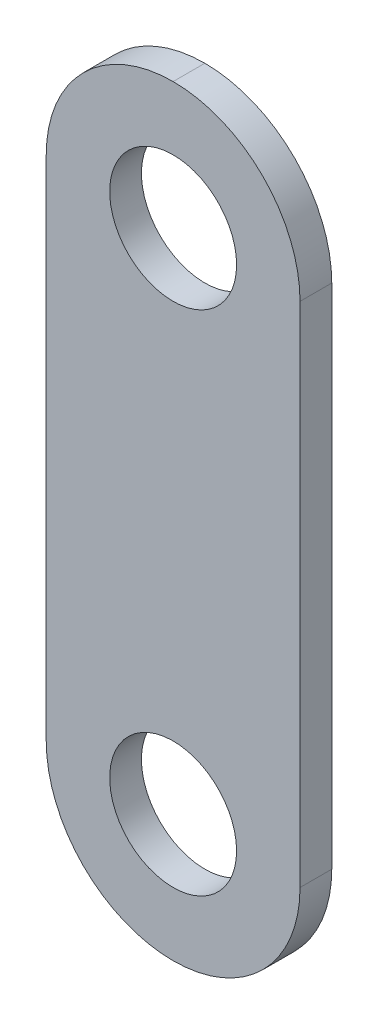
ISO-10303-21;
HEADER;
FILE_DESCRIPTION(('STEP AP214'),'2;1');
FILE_NAME('part.step','',(''),(''),'','','');
FILE_SCHEMA(('AUTOMOTIVE_DESIGN { 1 0 10303 214 1 1 1 1 }'));
ENDSEC;
DATA;
#1=APPLICATION_CONTEXT('core data for automotive mechanical design processes');
#2=APPLICATION_PROTOCOL_DEFINITION('international standard','automotive_design',2000,#1);
#3=PRODUCT_CONTEXT('',#1,'mechanical');
#4=PRODUCT('Part','Part','',(#3));
#5=PRODUCT_RELATED_PRODUCT_CATEGORY('part','',(#4));
#6=PRODUCT_DEFINITION_FORMATION('','',#4);
#7=PRODUCT_DEFINITION_CONTEXT('part definition',#1,'design');
#8=PRODUCT_DEFINITION('design','',#6,#7);
#9=PRODUCT_DEFINITION_SHAPE('','',#8);
#10=(LENGTH_UNIT() NAMED_UNIT(*) SI_UNIT(.MILLI.,.METRE.));
#11=(NAMED_UNIT(*) PLANE_ANGLE_UNIT() SI_UNIT($,.RADIAN.));
#12=(NAMED_UNIT(*) SI_UNIT($,.STERADIAN.) SOLID_ANGLE_UNIT());
#13=UNCERTAINTY_MEASURE_WITH_UNIT(LENGTH_MEASURE(1.E-05),#10,'distance_accuracy_value','');
#14=(GEOMETRIC_REPRESENTATION_CONTEXT(3) GLOBAL_UNCERTAINTY_ASSIGNED_CONTEXT((#13)) GLOBAL_UNIT_ASSIGNED_CONTEXT((#10,
#11,#12)) REPRESENTATION_CONTEXT('',''));
#15=CARTESIAN_POINT('',(0.,0.,0.));
#16=DIRECTION('',(0.,0.,1.));
#17=DIRECTION('',(1.,0.,0.));
#18=AXIS2_PLACEMENT_3D('',#15,#16,#17);
#19=CARTESIAN_POINT('',(0.,0.,1.5875));
#20=DIRECTION('',(0.,0.,-1.));
#21=DIRECTION('',(-1.,0.,0.));
#22=AXIS2_PLACEMENT_3D('',#19,#20,#21);
#23=PLANE('',#22);
#24=CARTESIAN_POINT('',(6.35,6.35,1.5875));
#25=DIRECTION('',(0.,0.,-1.));
#26=DIRECTION('',(-1.,0.,0.));
#27=AXIS2_PLACEMENT_3D('',#24,#25,#26);
#28=CIRCLE('',#27,6.35);
#29=CARTESIAN_POINT('',(0.,6.35,1.5875));
#30=VERTEX_POINT('',#29);
#31=CARTESIAN_POINT('',(6.35,0.,1.5875));
#32=VERTEX_POINT('',#31);
#33=EDGE_CURVE('E57',#30,#32,#28,.F.);
#34=ORIENTED_EDGE('',*,*,#33,.T.);
#35=CARTESIAN_POINT('',(6.35000000000001,6.35,1.5875));
#36=DIRECTION('',(0.,0.,-1.));
#37=DIRECTION('',(-1.,0.,0.));
#38=AXIS2_PLACEMENT_3D('',#35,#36,#37);
#39=CIRCLE('',#38,6.35);
#40=CARTESIAN_POINT('',(12.7,6.35,1.5875));
#41=VERTEX_POINT('',#40);
#42=EDGE_CURVE('E154',#32,#41,#39,.F.);
#43=ORIENTED_EDGE('',*,*,#42,.T.);
#44=DIRECTION('',(0.,1.,0.));
#45=VECTOR('',#44,1.);
#46=CARTESIAN_POINT('',(12.7,38.1,1.5875));
#47=LINE('',#46,#45);
#48=CARTESIAN_POINT('',(12.7,31.75,1.5875));
#49=VERTEX_POINT('',#48);
#50=EDGE_CURVE('E116',#41,#49,#47,.T.);
#51=ORIENTED_EDGE('',*,*,#50,.T.);
#52=CARTESIAN_POINT('',(6.35000000000001,31.75,1.5875));
#53=DIRECTION('',(0.,0.,-1.));
#54=DIRECTION('',(-1.,0.,0.));
#55=AXIS2_PLACEMENT_3D('',#52,#53,#54);
#56=CIRCLE('',#55,6.35);
#57=CARTESIAN_POINT('',(6.35,38.1,1.5875));
#58=VERTEX_POINT('',#57);
#59=EDGE_CURVE('E149',#49,#58,#56,.F.);
#60=ORIENTED_EDGE('',*,*,#59,.T.);
#61=CARTESIAN_POINT('',(6.35,31.75,1.5875));
#62=DIRECTION('',(0.,0.,-1.));
#63=DIRECTION('',(-1.,0.,0.));
#64=AXIS2_PLACEMENT_3D('',#61,#62,#63);
#65=CIRCLE('',#64,6.35);
#66=CARTESIAN_POINT('',(0.,31.75,1.5875));
#67=VERTEX_POINT('',#66);
#68=EDGE_CURVE('E105',#58,#67,#65,.F.);
#69=ORIENTED_EDGE('',*,*,#68,.T.);
#70=DIRECTION('',(0.,-1.,0.));
#71=VECTOR('',#70,1.);
#72=CARTESIAN_POINT('',(0.,0.,1.5875));
#73=LINE('',#72,#71);
#74=EDGE_CURVE('E136',#67,#30,#73,.T.);
#75=ORIENTED_EDGE('',*,*,#74,.T.);
#76=EDGE_LOOP('',(#34,#43,#51,#60,#69,#75));
#77=FACE_BOUND('',#76,.T.);
#78=CARTESIAN_POINT('',(6.35000000000001,31.75,1.5875));
#79=DIRECTION('',(0.,0.,1.));
#80=DIRECTION('',(1.,0.,0.));
#81=AXIS2_PLACEMENT_3D('',#78,#79,#80);
#82=CIRCLE('',#81,3.175);
#83=CARTESIAN_POINT('',(9.52500000000001,31.75,1.5875));
#84=VERTEX_POINT('',#83);
#85=EDGE_CURVE('E127',#84,#84,#82,.T.);
#86=ORIENTED_EDGE('',*,*,#85,.F.);
#87=EDGE_LOOP('',(#86));
#88=FACE_BOUND('',#87,.T.);
#89=CARTESIAN_POINT('',(6.35000000000001,6.35,1.5875));
#90=DIRECTION('',(0.,0.,1.));
#91=DIRECTION('',(1.,0.,0.));
#92=AXIS2_PLACEMENT_3D('',#89,#90,#91);
#93=CIRCLE('',#92,3.175);
#94=CARTESIAN_POINT('',(9.52500000000001,6.35,1.5875));
#95=VERTEX_POINT('',#94);
#96=EDGE_CURVE('E163',#95,#95,#93,.T.);
#97=ORIENTED_EDGE('',*,*,#96,.F.);
#98=EDGE_LOOP('',(#97));
#99=FACE_BOUND('',#98,.T.);
#100=ADVANCED_FACE('F39',(#77,#88,#99),#23,.F.);
#101=CARTESIAN_POINT('',(0.,0.,0.));
#102=DIRECTION('',(0.,0.,-1.));
#103=DIRECTION('',(-1.,0.,0.));
#104=AXIS2_PLACEMENT_3D('',#101,#102,#103);
#105=PLANE('',#104);
#106=CARTESIAN_POINT('',(6.35000000000001,31.75,0.));
#107=DIRECTION('',(0.,0.,1.));
#108=DIRECTION('',(1.,0.,0.));
#109=AXIS2_PLACEMENT_3D('',#106,#107,#108);
#110=CIRCLE('',#109,3.175);
#111=CARTESIAN_POINT('',(9.52500000000001,31.75,0.));
#112=VERTEX_POINT('',#111);
#113=EDGE_CURVE('E133',#112,#112,#110,.T.);
#114=ORIENTED_EDGE('',*,*,#113,.T.);
#115=EDGE_LOOP('',(#114));
#116=FACE_BOUND('',#115,.T.);
#117=DIRECTION('',(0.,1.,0.));
#118=VECTOR('',#117,1.);
#119=CARTESIAN_POINT('',(12.7,38.1,0.));
#120=LINE('',#119,#118);
#121=CARTESIAN_POINT('',(12.7,6.35,0.));
#122=VERTEX_POINT('',#121);
#123=CARTESIAN_POINT('',(12.7,31.75,0.));
#124=VERTEX_POINT('',#123);
#125=EDGE_CURVE('E113',#122,#124,#120,.T.);
#126=ORIENTED_EDGE('',*,*,#125,.F.);
#127=CARTESIAN_POINT('',(6.35000000000001,6.35,0.));
#128=DIRECTION('',(0.,0.,-1.));
#129=DIRECTION('',(-1.,0.,0.));
#130=AXIS2_PLACEMENT_3D('',#127,#128,#129);
#131=CIRCLE('',#130,6.35);
#132=CARTESIAN_POINT('',(6.35,0.,0.));
#133=VERTEX_POINT('',#132);
#134=EDGE_CURVE('E95',#122,#133,#131,.T.);
#135=ORIENTED_EDGE('',*,*,#134,.T.);
#136=CARTESIAN_POINT('',(6.35,6.35,0.));
#137=DIRECTION('',(0.,0.,-1.));
#138=DIRECTION('',(-1.,0.,0.));
#139=AXIS2_PLACEMENT_3D('',#136,#137,#138);
#140=CIRCLE('',#139,6.35);
#141=CARTESIAN_POINT('',(0.,6.35,0.));
#142=VERTEX_POINT('',#141);
#143=EDGE_CURVE('E106',#133,#142,#140,.T.);
#144=ORIENTED_EDGE('',*,*,#143,.T.);
#145=DIRECTION('',(0.,-1.,0.));
#146=VECTOR('',#145,1.);
#147=CARTESIAN_POINT('',(0.,0.,0.));
#148=LINE('',#147,#146);
#149=CARTESIAN_POINT('',(0.,31.75,0.));
#150=VERTEX_POINT('',#149);
#151=EDGE_CURVE('E126',#150,#142,#148,.T.);
#152=ORIENTED_EDGE('',*,*,#151,.F.);
#153=CARTESIAN_POINT('',(6.35,31.75,0.));
#154=DIRECTION('',(0.,0.,-1.));
#155=DIRECTION('',(-1.,0.,0.));
#156=AXIS2_PLACEMENT_3D('',#153,#154,#155);
#157=CIRCLE('',#156,6.35);
#158=CARTESIAN_POINT('',(6.35,38.1,0.));
#159=VERTEX_POINT('',#158);
#160=EDGE_CURVE('E118',#150,#159,#157,.T.);
#161=ORIENTED_EDGE('',*,*,#160,.T.);
#162=CARTESIAN_POINT('',(6.35000000000001,31.75,0.));
#163=DIRECTION('',(0.,0.,-1.));
#164=DIRECTION('',(-1.,0.,0.));
#165=AXIS2_PLACEMENT_3D('',#162,#163,#164);
#166=CIRCLE('',#165,6.35);
#167=EDGE_CURVE('E124',#159,#124,#166,.T.);
#168=ORIENTED_EDGE('',*,*,#167,.T.);
#169=EDGE_LOOP('',(#126,#135,#144,#152,#161,#168));
#170=FACE_BOUND('',#169,.T.);
#171=CARTESIAN_POINT('',(6.35000000000001,6.35,0.));
#172=DIRECTION('',(0.,0.,1.));
#173=DIRECTION('',(1.,0.,0.));
#174=AXIS2_PLACEMENT_3D('',#171,#172,#173);
#175=CIRCLE('',#174,3.175);
#176=CARTESIAN_POINT('',(9.52500000000001,6.35,0.));
#177=VERTEX_POINT('',#176);
#178=EDGE_CURVE('E159',#177,#177,#175,.T.);
#179=ORIENTED_EDGE('',*,*,#178,.T.);
#180=EDGE_LOOP('',(#179));
#181=FACE_BOUND('',#180,.T.);
#182=ADVANCED_FACE('F121',(#116,#170,#181),#105,.T.);
#183=CARTESIAN_POINT('',(12.7,38.1,1.5875));
#184=DIRECTION('',(-1.,0.,0.));
#185=DIRECTION('',(0.,-1.,0.));
#186=AXIS2_PLACEMENT_3D('',#183,#184,#185);
#187=PLANE('',#186);
#188=ORIENTED_EDGE('',*,*,#50,.F.);
#189=DIRECTION('',(0.,0.,-1.));
#190=VECTOR('',#189,1.);
#191=CARTESIAN_POINT('',(12.7,6.35,1.5875));
#192=LINE('',#191,#190);
#193=EDGE_CURVE('E99',#41,#122,#192,.T.);
#194=ORIENTED_EDGE('',*,*,#193,.T.);
#195=ORIENTED_EDGE('',*,*,#125,.T.);
#196=DIRECTION('',(0.,0.,-1.));
#197=VECTOR('',#196,1.);
#198=CARTESIAN_POINT('',(12.7,31.75,1.5875));
#199=LINE('',#198,#197);
#200=EDGE_CURVE('E119',#124,#49,#199,.F.);
#201=ORIENTED_EDGE('',*,*,#200,.T.);
#202=EDGE_LOOP('',(#188,#194,#195,#201));
#203=FACE_BOUND('',#202,.T.);
#204=ADVANCED_FACE('F111',(#203),#187,.F.);
#205=CARTESIAN_POINT('',(0.,0.,1.5875));
#206=DIRECTION('',(1.,0.,0.));
#207=DIRECTION('',(0.,1.,0.));
#208=AXIS2_PLACEMENT_3D('',#205,#206,#207);
#209=PLANE('',#208);
#210=ORIENTED_EDGE('',*,*,#151,.T.);
#211=DIRECTION('',(0.,0.,-1.));
#212=VECTOR('',#211,1.);
#213=CARTESIAN_POINT('',(0.,6.35,1.5875));
#214=LINE('',#213,#212);
#215=EDGE_CURVE('E11',#142,#30,#214,.F.);
#216=ORIENTED_EDGE('',*,*,#215,.T.);
#217=ORIENTED_EDGE('',*,*,#74,.F.);
#218=DIRECTION('',(0.,0.,-1.));
#219=VECTOR('',#218,1.);
#220=CARTESIAN_POINT('',(0.,31.75,1.5875));
#221=LINE('',#220,#219);
#222=EDGE_CURVE('E49',#67,#150,#221,.T.);
#223=ORIENTED_EDGE('',*,*,#222,.T.);
#224=EDGE_LOOP('',(#210,#216,#217,#223));
#225=FACE_BOUND('',#224,.T.);
#226=ADVANCED_FACE('F174',(#225),#209,.F.);
#227=CARTESIAN_POINT('',(6.35000000000001,31.75,1.5875));
#228=DIRECTION('',(0.,0.,-1.));
#229=DIRECTION('',(-1.,0.,0.));
#230=AXIS2_PLACEMENT_3D('',#227,#228,#229);
#231=CYLINDRICAL_SURFACE('',#230,3.175);
#232=ORIENTED_EDGE('',*,*,#85,.T.);
#233=EDGE_LOOP('',(#232));
#234=FACE_BOUND('',#233,.T.);
#235=ORIENTED_EDGE('',*,*,#113,.F.);
#236=EDGE_LOOP('',(#235));
#237=FACE_BOUND('',#236,.T.);
#238=ADVANCED_FACE('F197',(#234,#237),#231,.F.);
#239=CARTESIAN_POINT('',(6.35000000000001,6.35,1.5875));
#240=DIRECTION('',(0.,0.,-1.));
#241=DIRECTION('',(-1.,0.,0.));
#242=AXIS2_PLACEMENT_3D('',#239,#240,#241);
#243=CYLINDRICAL_SURFACE('',#242,3.175);
#244=ORIENTED_EDGE('',*,*,#96,.T.);
#245=EDGE_LOOP('',(#244));
#246=FACE_BOUND('',#245,.T.);
#247=ORIENTED_EDGE('',*,*,#178,.F.);
#248=EDGE_LOOP('',(#247));
#249=FACE_BOUND('',#248,.T.);
#250=ADVANCED_FACE('F186',(#246,#249),#243,.F.);
#251=CARTESIAN_POINT('',(6.35,6.35,1.5875));
#252=DIRECTION('',(0.,0.,-1.));
#253=DIRECTION('',(-1.,0.,0.));
#254=AXIS2_PLACEMENT_3D('',#251,#252,#253);
#255=CYLINDRICAL_SURFACE('',#254,6.35);
#256=DIRECTION('',(0.,0.,-1.));
#257=VECTOR('',#256,1.);
#258=CARTESIAN_POINT('',(6.35,0.,1.5875));
#259=LINE('',#258,#257);
#260=EDGE_CURVE('E100',#32,#133,#259,.T.);
#261=ORIENTED_EDGE('',*,*,#260,.F.);
#262=ORIENTED_EDGE('',*,*,#33,.F.);
#263=ORIENTED_EDGE('',*,*,#215,.F.);
#264=ORIENTED_EDGE('',*,*,#143,.F.);
#265=EDGE_LOOP('',(#261,#262,#263,#264));
#266=FACE_BOUND('',#265,.T.);
#267=ADVANCED_FACE('F206',(#266),#255,.T.);
#268=CARTESIAN_POINT('',(6.35000000000001,6.35,1.5875));
#269=DIRECTION('',(0.,0.,-1.));
#270=DIRECTION('',(-1.,0.,0.));
#271=AXIS2_PLACEMENT_3D('',#268,#269,#270);
#272=CYLINDRICAL_SURFACE('',#271,6.35);
#273=ORIENTED_EDGE('',*,*,#42,.F.);
#274=ORIENTED_EDGE('',*,*,#260,.T.);
#275=ORIENTED_EDGE('',*,*,#134,.F.);
#276=ORIENTED_EDGE('',*,*,#193,.F.);
#277=EDGE_LOOP('',(#273,#274,#275,#276));
#278=FACE_BOUND('',#277,.T.);
#279=ADVANCED_FACE('F98',(#278),#272,.T.);
#280=CARTESIAN_POINT('',(6.35,31.75,1.5875));
#281=DIRECTION('',(0.,0.,-1.));
#282=DIRECTION('',(-1.,0.,0.));
#283=AXIS2_PLACEMENT_3D('',#280,#281,#282);
#284=CYLINDRICAL_SURFACE('',#283,6.35);
#285=ORIENTED_EDGE('',*,*,#222,.F.);
#286=ORIENTED_EDGE('',*,*,#68,.F.);
#287=DIRECTION('',(0.,0.,-1.));
#288=VECTOR('',#287,1.);
#289=CARTESIAN_POINT('',(6.35,38.1,1.5875));
#290=LINE('',#289,#288);
#291=EDGE_CURVE('E43',#159,#58,#290,.F.);
#292=ORIENTED_EDGE('',*,*,#291,.F.);
#293=ORIENTED_EDGE('',*,*,#160,.F.);
#294=EDGE_LOOP('',(#285,#286,#292,#293));
#295=FACE_BOUND('',#294,.T.);
#296=ADVANCED_FACE('F41',(#295),#284,.T.);
#297=CARTESIAN_POINT('',(6.35000000000001,31.75,1.5875));
#298=DIRECTION('',(0.,0.,-1.));
#299=DIRECTION('',(-1.,0.,0.));
#300=AXIS2_PLACEMENT_3D('',#297,#298,#299);
#301=CYLINDRICAL_SURFACE('',#300,6.35);
#302=ORIENTED_EDGE('',*,*,#59,.F.);
#303=ORIENTED_EDGE('',*,*,#200,.F.);
#304=ORIENTED_EDGE('',*,*,#167,.F.);
#305=ORIENTED_EDGE('',*,*,#291,.T.);
#306=EDGE_LOOP('',(#302,#303,#304,#305));
#307=FACE_BOUND('',#306,.T.);
#308=ADVANCED_FACE('F168',(#307),#301,.T.);
#309=CLOSED_SHELL('',(#100,#182,#204,#226,#238,#250,#267,#279,#296,#308));
#310=MANIFOLD_SOLID_BREP('B2',#309);
#311=ADVANCED_BREP_SHAPE_REPRESENTATION('',(#18,#310),#14);
#312=SHAPE_DEFINITION_REPRESENTATION(#9,#311);
ENDSEC;
END-ISO-10303-21;
